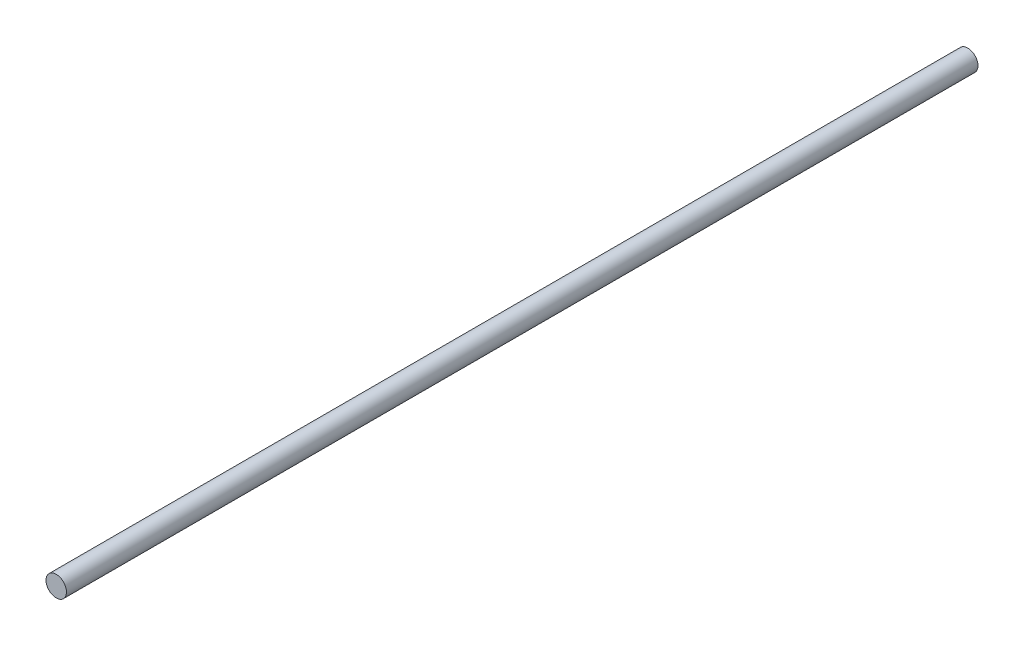
ISO-10303-21;
HEADER;
FILE_DESCRIPTION(('STEP AP214'),'2;1');
FILE_NAME('part.step','',(''),(''),'','','');
FILE_SCHEMA(('AUTOMOTIVE_DESIGN { 1 0 10303 214 1 1 1 1 }'));
ENDSEC;
DATA;
#1=APPLICATION_CONTEXT('core data for automotive mechanical design processes');
#2=APPLICATION_PROTOCOL_DEFINITION('international standard','automotive_design',2000,#1);
#3=PRODUCT_CONTEXT('',#1,'mechanical');
#4=PRODUCT('Part','Part','',(#3));
#5=PRODUCT_RELATED_PRODUCT_CATEGORY('part','',(#4));
#6=PRODUCT_DEFINITION_FORMATION('','',#4);
#7=PRODUCT_DEFINITION_CONTEXT('part definition',#1,'design');
#8=PRODUCT_DEFINITION('design','',#6,#7);
#9=PRODUCT_DEFINITION_SHAPE('','',#8);
#10=(LENGTH_UNIT() NAMED_UNIT(*) SI_UNIT(.MILLI.,.METRE.));
#11=(NAMED_UNIT(*) PLANE_ANGLE_UNIT() SI_UNIT($,.RADIAN.));
#12=(NAMED_UNIT(*) SI_UNIT($,.STERADIAN.) SOLID_ANGLE_UNIT());
#13=UNCERTAINTY_MEASURE_WITH_UNIT(LENGTH_MEASURE(1.E-05),#10,'distance_accuracy_value','');
#14=(GEOMETRIC_REPRESENTATION_CONTEXT(3) GLOBAL_UNCERTAINTY_ASSIGNED_CONTEXT((#13)) GLOBAL_UNIT_ASSIGNED_CONTEXT((#10,
#11,#12)) REPRESENTATION_CONTEXT('',''));
#15=CARTESIAN_POINT('',(0.,0.,0.));
#16=DIRECTION('',(0.,0.,1.));
#17=DIRECTION('',(1.,0.,0.));
#18=AXIS2_PLACEMENT_3D('',#15,#16,#17);
#19=CARTESIAN_POINT('',(0.,0.,356.));
#20=DIRECTION('',(0.,0.,-1.));
#21=DIRECTION('',(-1.,0.,0.));
#22=AXIS2_PLACEMENT_3D('',#19,#20,#21);
#23=CYLINDRICAL_SURFACE('',#22,4.);
#24=CARTESIAN_POINT('',(0.,0.,356.));
#25=DIRECTION('',(0.,0.,1.));
#26=DIRECTION('',(1.,0.,0.));
#27=AXIS2_PLACEMENT_3D('',#24,#25,#26);
#28=CIRCLE('',#27,4.);
#29=CARTESIAN_POINT('',(4.,0.,356.));
#30=VERTEX_POINT('',#29);
#31=EDGE_CURVE('E10',#30,#30,#28,.T.);
#32=ORIENTED_EDGE('',*,*,#31,.F.);
#33=EDGE_LOOP('',(#32));
#34=FACE_BOUND('',#33,.T.);
#35=CARTESIAN_POINT('',(0.,0.,0.));
#36=DIRECTION('',(0.,0.,1.));
#37=DIRECTION('',(1.,0.,0.));
#38=AXIS2_PLACEMENT_3D('',#35,#36,#37);
#39=CIRCLE('',#38,4.);
#40=CARTESIAN_POINT('',(4.,0.,0.));
#41=VERTEX_POINT('',#40);
#42=EDGE_CURVE('E35',#41,#41,#39,.T.);
#43=ORIENTED_EDGE('',*,*,#42,.T.);
#44=EDGE_LOOP('',(#43));
#45=FACE_BOUND('',#44,.T.);
#46=ADVANCED_FACE('F32',(#34,#45),#23,.T.);
#47=CARTESIAN_POINT('',(0.,0.,356.));
#48=DIRECTION('',(0.,0.,1.));
#49=DIRECTION('',(1.,0.,0.));
#50=AXIS2_PLACEMENT_3D('',#47,#48,#49);
#51=PLANE('',#50);
#52=ORIENTED_EDGE('',*,*,#31,.T.);
#53=EDGE_LOOP('',(#52));
#54=FACE_BOUND('',#53,.T.);
#55=ADVANCED_FACE('F47',(#54),#51,.T.);
#56=CARTESIAN_POINT('',(0.,0.,0.));
#57=DIRECTION('',(0.,0.,1.));
#58=DIRECTION('',(1.,0.,0.));
#59=AXIS2_PLACEMENT_3D('',#56,#57,#58);
#60=PLANE('',#59);
#61=ORIENTED_EDGE('',*,*,#42,.F.);
#62=EDGE_LOOP('',(#61));
#63=FACE_BOUND('',#62,.T.);
#64=ADVANCED_FACE('F45',(#63),#60,.F.);
#65=CLOSED_SHELL('',(#46,#55,#64));
#66=MANIFOLD_SOLID_BREP('B2',#65);
#67=ADVANCED_BREP_SHAPE_REPRESENTATION('',(#18,#66),#14);
#68=SHAPE_DEFINITION_REPRESENTATION(#9,#67);
ENDSEC;
END-ISO-10303-21;
